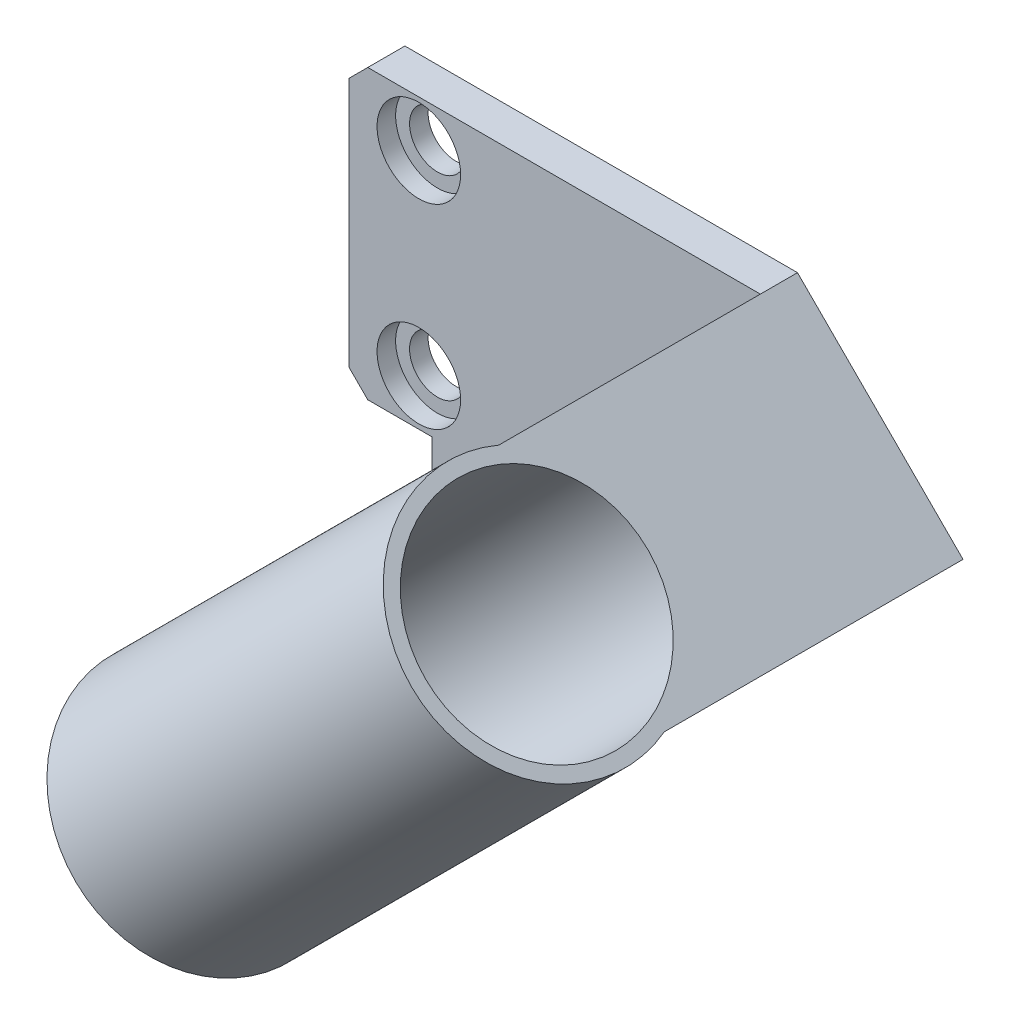
ISO-10303-21;
HEADER;
FILE_DESCRIPTION(('STEP AP214'),'2;1');
FILE_NAME('part.step','',(''),(''),'','','');
FILE_SCHEMA(('AUTOMOTIVE_DESIGN { 1 0 10303 214 1 1 1 1 }'));
ENDSEC;
DATA;
#1=APPLICATION_CONTEXT('core data for automotive mechanical design processes');
#2=APPLICATION_PROTOCOL_DEFINITION('international standard','automotive_design',2000,#1);
#3=PRODUCT_CONTEXT('',#1,'mechanical');
#4=PRODUCT('Part','Part','',(#3));
#5=PRODUCT_RELATED_PRODUCT_CATEGORY('part','',(#4));
#6=PRODUCT_DEFINITION_FORMATION('','',#4);
#7=PRODUCT_DEFINITION_CONTEXT('part definition',#1,'design');
#8=PRODUCT_DEFINITION('design','',#6,#7);
#9=PRODUCT_DEFINITION_SHAPE('','',#8);
#10=(LENGTH_UNIT() NAMED_UNIT(*) SI_UNIT(.MILLI.,.METRE.));
#11=(NAMED_UNIT(*) PLANE_ANGLE_UNIT() SI_UNIT($,.RADIAN.));
#12=(NAMED_UNIT(*) SI_UNIT($,.STERADIAN.) SOLID_ANGLE_UNIT());
#13=UNCERTAINTY_MEASURE_WITH_UNIT(LENGTH_MEASURE(1.E-05),#10,'distance_accuracy_value','');
#14=(GEOMETRIC_REPRESENTATION_CONTEXT(3) GLOBAL_UNCERTAINTY_ASSIGNED_CONTEXT((#13)) GLOBAL_UNIT_ASSIGNED_CONTEXT((#10,
#11,#12)) REPRESENTATION_CONTEXT('',''));
#15=CARTESIAN_POINT('',(0.,0.,0.));
#16=DIRECTION('',(0.,0.,1.));
#17=DIRECTION('',(1.,0.,0.));
#18=AXIS2_PLACEMENT_3D('',#15,#16,#17);
#19=CARTESIAN_POINT('',(0.,0.,4.));
#20=DIRECTION('',(0.,0.,-1.));
#21=DIRECTION('',(-1.,0.,0.));
#22=AXIS2_PLACEMENT_3D('',#19,#20,#21);
#23=PLANE('',#22);
#24=CARTESIAN_POINT('',(0.,0.,4.));
#25=DIRECTION('',(0.,0.,1.));
#26=DIRECTION('',(1.,0.,0.));
#27=AXIS2_PLACEMENT_3D('',#24,#25,#26);
#28=CIRCLE('',#27,4.5);
#29=CARTESIAN_POINT('',(4.5,0.,4.));
#30=VERTEX_POINT('',#29);
#31=EDGE_CURVE('E175',#30,#30,#28,.T.);
#32=ORIENTED_EDGE('',*,*,#31,.F.);
#33=EDGE_LOOP('',(#32));
#34=FACE_BOUND('',#33,.T.);
#35=CARTESIAN_POINT('',(0.,21.,4.));
#36=DIRECTION('',(0.,0.,1.));
#37=DIRECTION('',(1.,0.,0.));
#38=AXIS2_PLACEMENT_3D('',#35,#36,#37);
#39=CIRCLE('',#38,4.5);
#40=CARTESIAN_POINT('',(4.5,21.,4.));
#41=VERTEX_POINT('',#40);
#42=EDGE_CURVE('E180',#41,#41,#39,.T.);
#43=ORIENTED_EDGE('',*,*,#42,.F.);
#44=EDGE_LOOP('',(#43));
#45=FACE_BOUND('',#44,.T.);
#46=DIRECTION('',(-0.690146856604744,-0.723669341839622,0.));
#47=VECTOR('',#46,1.);
#48=CARTESIAN_POINT('',(1.42306306806194,-11.0769369319382,4.));
#49=LINE('',#48,#47);
#50=CARTESIAN_POINT('',(36.7824875962055,26.,4.));
#51=VERTEX_POINT('',#50);
#52=CARTESIAN_POINT('',(1.42306306806194,-11.0769369319382,4.));
#53=VERTEX_POINT('',#52);
#54=EDGE_CURVE('E151',#51,#53,#49,.T.);
#55=ORIENTED_EDGE('',*,*,#54,.F.);
#56=DIRECTION('',(-1.,0.,0.));
#57=VECTOR('',#56,1.);
#58=CARTESIAN_POINT('',(-7.5,26.,4.));
#59=LINE('',#58,#57);
#60=CARTESIAN_POINT('',(-5.49999999999999,26.,4.));
#61=VERTEX_POINT('',#60);
#62=EDGE_CURVE('E196',#51,#61,#59,.T.);
#63=ORIENTED_EDGE('',*,*,#62,.T.);
#64=DIRECTION('',(0.707106781186549,0.707106781186546,0.));
#65=VECTOR('',#64,1.);
#66=CARTESIAN_POINT('',(-7.5,24.,4.));
#67=LINE('',#66,#65);
#68=CARTESIAN_POINT('',(-7.5,24.,4.));
#69=VERTEX_POINT('',#68);
#70=EDGE_CURVE('E227',#61,#69,#67,.F.);
#71=ORIENTED_EDGE('',*,*,#70,.T.);
#72=DIRECTION('',(0.,-1.,0.));
#73=VECTOR('',#72,1.);
#74=CARTESIAN_POINT('',(-7.5,-4.99999999999999,4.));
#75=LINE('',#74,#73);
#76=CARTESIAN_POINT('',(-7.5,-2.99999999999998,4.));
#77=VERTEX_POINT('',#76);
#78=EDGE_CURVE('E198',#69,#77,#75,.T.);
#79=ORIENTED_EDGE('',*,*,#78,.T.);
#80=DIRECTION('',(-0.707106781186546,0.707106781186549,0.));
#81=VECTOR('',#80,1.);
#82=CARTESIAN_POINT('',(-5.5,-4.99999999999999,4.));
#83=LINE('',#82,#81);
#84=CARTESIAN_POINT('',(-5.5,-4.99999999999999,4.));
#85=VERTEX_POINT('',#84);
#86=EDGE_CURVE('E46',#77,#85,#83,.F.);
#87=ORIENTED_EDGE('',*,*,#86,.T.);
#88=DIRECTION('',(1.,0.,0.));
#89=VECTOR('',#88,1.);
#90=CARTESIAN_POINT('',(-7.5,-4.99999999999999,4.));
#91=LINE('',#90,#89);
#92=CARTESIAN_POINT('',(1.42306306806194,-4.99999999999999,4.));
#93=VERTEX_POINT('',#92);
#94=EDGE_CURVE('E202',#85,#93,#91,.T.);
#95=ORIENTED_EDGE('',*,*,#94,.T.);
#96=DIRECTION('',(0.,-1.,0.));
#97=VECTOR('',#96,1.);
#98=CARTESIAN_POINT('',(1.42306306806194,-11.0769369319382,4.));
#99=LINE('',#98,#97);
#100=EDGE_CURVE('E53',#93,#53,#99,.T.);
#101=ORIENTED_EDGE('',*,*,#100,.T.);
#102=EDGE_LOOP('',(#55,#63,#71,#79,#87,#95,#101));
#103=FACE_BOUND('',#102,.T.);
#104=ADVANCED_FACE('F38',(#34,#45,#103),#23,.F.);
#105=CARTESIAN_POINT('',(0.,0.,4.));
#106=DIRECTION('',(0.,0.,-1.));
#107=DIRECTION('',(-1.,0.,0.));
#108=AXIS2_PLACEMENT_3D('',#105,#106,#107);
#109=CYLINDRICAL_SURFACE('',#108,3.);
#110=CARTESIAN_POINT('',(0.,0.,0.));
#111=DIRECTION('',(0.,0.,1.));
#112=DIRECTION('',(1.,0.,0.));
#113=AXIS2_PLACEMENT_3D('',#110,#111,#112);
#114=CIRCLE('',#113,3.);
#115=CARTESIAN_POINT('',(3.,0.,0.));
#116=VERTEX_POINT('',#115);
#117=EDGE_CURVE('E191',#116,#116,#114,.T.);
#118=ORIENTED_EDGE('',*,*,#117,.F.);
#119=EDGE_LOOP('',(#118));
#120=FACE_BOUND('',#119,.T.);
#121=CARTESIAN_POINT('',(0.,0.,2.));
#122=DIRECTION('',(0.,0.,1.));
#123=DIRECTION('',(1.,0.,0.));
#124=AXIS2_PLACEMENT_3D('',#121,#122,#123);
#125=CIRCLE('',#124,3.);
#126=CARTESIAN_POINT('',(3.,0.,2.));
#127=VERTEX_POINT('',#126);
#128=EDGE_CURVE('E192',#127,#127,#125,.T.);
#129=ORIENTED_EDGE('',*,*,#128,.T.);
#130=EDGE_LOOP('',(#129));
#131=FACE_BOUND('',#130,.T.);
#132=ADVANCED_FACE('F273',(#120,#131),#109,.F.);
#133=CARTESIAN_POINT('',(0.,21.,4.));
#134=DIRECTION('',(0.,0.,-1.));
#135=DIRECTION('',(-1.,0.,0.));
#136=AXIS2_PLACEMENT_3D('',#133,#134,#135);
#137=CYLINDRICAL_SURFACE('',#136,3.);
#138=CARTESIAN_POINT('',(0.,21.,0.));
#139=DIRECTION('',(0.,0.,1.));
#140=DIRECTION('',(1.,0.,0.));
#141=AXIS2_PLACEMENT_3D('',#138,#139,#140);
#142=CIRCLE('',#141,3.);
#143=CARTESIAN_POINT('',(3.,21.,0.));
#144=VERTEX_POINT('',#143);
#145=EDGE_CURVE('E188',#144,#144,#142,.T.);
#146=ORIENTED_EDGE('',*,*,#145,.F.);
#147=EDGE_LOOP('',(#146));
#148=FACE_BOUND('',#147,.T.);
#149=CARTESIAN_POINT('',(0.,21.,2.));
#150=DIRECTION('',(0.,0.,1.));
#151=DIRECTION('',(1.,0.,0.));
#152=AXIS2_PLACEMENT_3D('',#149,#150,#151);
#153=CIRCLE('',#152,3.);
#154=CARTESIAN_POINT('',(3.,21.,2.));
#155=VERTEX_POINT('',#154);
#156=EDGE_CURVE('E179',#155,#155,#153,.T.);
#157=ORIENTED_EDGE('',*,*,#156,.T.);
#158=EDGE_LOOP('',(#157));
#159=FACE_BOUND('',#158,.T.);
#160=ADVANCED_FACE('F279',(#148,#159),#137,.F.);
#161=CARTESIAN_POINT('',(0.,0.,0.));
#162=DIRECTION('',(0.,0.,-1.));
#163=DIRECTION('',(-1.,0.,0.));
#164=AXIS2_PLACEMENT_3D('',#161,#162,#163);
#165=PLANE('',#164);
#166=DIRECTION('',(-1.,0.,0.));
#167=VECTOR('',#166,1.);
#168=CARTESIAN_POINT('',(-7.5,26.,0.));
#169=LINE('',#168,#167);
#170=CARTESIAN_POINT('',(36.7824875962055,26.,0.));
#171=VERTEX_POINT('',#170);
#172=CARTESIAN_POINT('',(-5.49999999999999,26.,0.));
#173=VERTEX_POINT('',#172);
#174=EDGE_CURVE('E195',#171,#173,#169,.T.);
#175=ORIENTED_EDGE('',*,*,#174,.F.);
#176=DIRECTION('',(-0.707106781186549,0.707106781186546,0.));
#177=VECTOR('',#176,1.);
#178=CARTESIAN_POINT('',(54.6118065465798,8.17068104962578,0.));
#179=LINE('',#178,#177);
#180=CARTESIAN_POINT('',(54.6118065465798,8.17068104962578,0.));
#181=VERTEX_POINT('',#180);
#182=EDGE_CURVE('E160',#181,#171,#179,.T.);
#183=ORIENTED_EDGE('',*,*,#182,.F.);
#184=DIRECTION('',(0.707106781186546,0.707106781186549,0.));
#185=VECTOR('',#184,1.);
#186=CARTESIAN_POINT('',(41.4411254969541,-4.99999999999999,0.));
#187=LINE('',#186,#185);
#188=CARTESIAN_POINT('',(18.3936258165389,-28.0474996804152,0.));
#189=VERTEX_POINT('',#188);
#190=EDGE_CURVE('E137',#189,#181,#187,.T.);
#191=ORIENTED_EDGE('',*,*,#190,.F.);
#192=DIRECTION('',(0.707106781186548,-0.707106781186548,0.));
#193=VECTOR('',#192,1.);
#194=CARTESIAN_POINT('',(1.42306306806194,-11.0769369319382,0.));
#195=LINE('',#194,#193);
#196=CARTESIAN_POINT('',(1.42306306806194,-11.0769369319382,0.));
#197=VERTEX_POINT('',#196);
#198=EDGE_CURVE('E134',#197,#189,#195,.T.);
#199=ORIENTED_EDGE('',*,*,#198,.F.);
#200=DIRECTION('',(0.,-1.,0.));
#201=VECTOR('',#200,1.);
#202=CARTESIAN_POINT('',(1.42306306806194,-11.0769369319382,0.));
#203=LINE('',#202,#201);
#204=CARTESIAN_POINT('',(1.42306306806194,-4.99999999999999,0.));
#205=VERTEX_POINT('',#204);
#206=EDGE_CURVE('E167',#205,#197,#203,.T.);
#207=ORIENTED_EDGE('',*,*,#206,.F.);
#208=DIRECTION('',(1.,0.,0.));
#209=VECTOR('',#208,1.);
#210=CARTESIAN_POINT('',(-7.5,-4.99999999999999,0.));
#211=LINE('',#210,#209);
#212=CARTESIAN_POINT('',(-5.5,-4.99999999999999,0.));
#213=VERTEX_POINT('',#212);
#214=EDGE_CURVE('E199',#213,#205,#211,.T.);
#215=ORIENTED_EDGE('',*,*,#214,.F.);
#216=DIRECTION('',(0.707106781186546,-0.707106781186549,0.));
#217=VECTOR('',#216,1.);
#218=CARTESIAN_POINT('',(-5.25000000000001,-5.24999999999998,0.));
#219=LINE('',#218,#217);
#220=CARTESIAN_POINT('',(-7.5,-2.99999999999998,0.));
#221=VERTEX_POINT('',#220);
#222=EDGE_CURVE('E220',#213,#221,#219,.F.);
#223=ORIENTED_EDGE('',*,*,#222,.T.);
#224=DIRECTION('',(0.,-1.,0.));
#225=VECTOR('',#224,1.);
#226=CARTESIAN_POINT('',(-7.5,-4.99999999999999,0.));
#227=LINE('',#226,#225);
#228=CARTESIAN_POINT('',(-7.5,24.,0.));
#229=VERTEX_POINT('',#228);
#230=EDGE_CURVE('E207',#229,#221,#227,.T.);
#231=ORIENTED_EDGE('',*,*,#230,.F.);
#232=DIRECTION('',(-0.707106781186549,-0.707106781186546,0.));
#233=VECTOR('',#232,1.);
#234=CARTESIAN_POINT('',(-15.75,15.7500000000001,0.));
#235=LINE('',#234,#233);
#236=EDGE_CURVE('E218',#229,#173,#235,.F.);
#237=ORIENTED_EDGE('',*,*,#236,.T.);
#238=EDGE_LOOP('',(#175,#183,#191,#199,#207,#215,#223,#231,#237));
#239=FACE_BOUND('',#238,.T.);
#240=ORIENTED_EDGE('',*,*,#117,.T.);
#241=EDGE_LOOP('',(#240));
#242=FACE_BOUND('',#241,.T.);
#243=ORIENTED_EDGE('',*,*,#145,.T.);
#244=EDGE_LOOP('',(#243));
#245=FACE_BOUND('',#244,.T.);
#246=ADVANCED_FACE('F241',(#239,#242,#245),#165,.T.);
#247=CARTESIAN_POINT('',(-7.5,26.,4.));
#248=DIRECTION('',(0.,-1.,0.));
#249=DIRECTION('',(0.,0.,-1.));
#250=AXIS2_PLACEMENT_3D('',#247,#248,#249);
#251=PLANE('',#250);
#252=ORIENTED_EDGE('',*,*,#174,.T.);
#253=DIRECTION('',(0.,0.,1.));
#254=VECTOR('',#253,1.);
#255=CARTESIAN_POINT('',(-5.49999999999999,26.,4.));
#256=LINE('',#255,#254);
#257=EDGE_CURVE('E11',#173,#61,#256,.T.);
#258=ORIENTED_EDGE('',*,*,#257,.T.);
#259=ORIENTED_EDGE('',*,*,#62,.F.);
#260=DIRECTION('',(0.,0.,1.));
#261=VECTOR('',#260,1.);
#262=CARTESIAN_POINT('',(36.7824875962055,26.,-75.8299060696244));
#263=LINE('',#262,#261);
#264=EDGE_CURVE('E163',#171,#51,#263,.T.);
#265=ORIENTED_EDGE('',*,*,#264,.F.);
#266=EDGE_LOOP('',(#252,#258,#259,#265));
#267=FACE_BOUND('',#266,.T.);
#268=ADVANCED_FACE('F249',(#267),#251,.F.);
#269=CARTESIAN_POINT('',(-7.5,-4.99999999999999,4.));
#270=DIRECTION('',(1.,0.,0.));
#271=DIRECTION('',(0.,0.,-1.));
#272=AXIS2_PLACEMENT_3D('',#269,#270,#271);
#273=PLANE('',#272);
#274=ORIENTED_EDGE('',*,*,#230,.T.);
#275=DIRECTION('',(0.,0.,1.));
#276=VECTOR('',#275,1.);
#277=CARTESIAN_POINT('',(-7.5,-2.99999999999998,4.));
#278=LINE('',#277,#276);
#279=EDGE_CURVE('E225',#221,#77,#278,.T.);
#280=ORIENTED_EDGE('',*,*,#279,.T.);
#281=ORIENTED_EDGE('',*,*,#78,.F.);
#282=DIRECTION('',(0.,0.,-1.));
#283=VECTOR('',#282,1.);
#284=CARTESIAN_POINT('',(-7.5,24.,4.));
#285=LINE('',#284,#283);
#286=EDGE_CURVE('E222',#69,#229,#285,.T.);
#287=ORIENTED_EDGE('',*,*,#286,.T.);
#288=EDGE_LOOP('',(#274,#280,#281,#287));
#289=FACE_BOUND('',#288,.T.);
#290=ADVANCED_FACE('F244',(#289),#273,.F.);
#291=CARTESIAN_POINT('',(-7.5,-4.99999999999999,4.));
#292=DIRECTION('',(0.,1.,0.));
#293=DIRECTION('',(0.,0.,1.));
#294=AXIS2_PLACEMENT_3D('',#291,#292,#293);
#295=PLANE('',#294);
#296=ORIENTED_EDGE('',*,*,#214,.T.);
#297=DIRECTION('',(0.,0.,1.));
#298=VECTOR('',#297,1.);
#299=CARTESIAN_POINT('',(1.42306306806194,-4.99999999999999,-75.8299060696244));
#300=LINE('',#299,#298);
#301=EDGE_CURVE('E159',#205,#93,#300,.T.);
#302=ORIENTED_EDGE('',*,*,#301,.T.);
#303=ORIENTED_EDGE('',*,*,#94,.F.);
#304=DIRECTION('',(0.,0.,-1.));
#305=VECTOR('',#304,1.);
#306=CARTESIAN_POINT('',(-5.5,-4.99999999999999,4.));
#307=LINE('',#306,#305);
#308=EDGE_CURVE('E205',#85,#213,#307,.T.);
#309=ORIENTED_EDGE('',*,*,#308,.T.);
#310=EDGE_LOOP('',(#296,#302,#303,#309));
#311=FACE_BOUND('',#310,.T.);
#312=ADVANCED_FACE('F236',(#311),#295,.F.);
#313=CARTESIAN_POINT('',(0.,21.,2.));
#314=DIRECTION('',(0.,0.,1.));
#315=DIRECTION('',(1.,0.,0.));
#316=AXIS2_PLACEMENT_3D('',#313,#314,#315);
#317=CYLINDRICAL_SURFACE('',#316,4.5);
#318=CARTESIAN_POINT('',(0.,21.,2.));
#319=DIRECTION('',(0.,0.,1.));
#320=DIRECTION('',(1.,0.,0.));
#321=AXIS2_PLACEMENT_3D('',#318,#319,#320);
#322=CIRCLE('',#321,4.5);
#323=CARTESIAN_POINT('',(4.5,21.,2.));
#324=VERTEX_POINT('',#323);
#325=EDGE_CURVE('E176',#324,#324,#322,.T.);
#326=ORIENTED_EDGE('',*,*,#325,.F.);
#327=EDGE_LOOP('',(#326));
#328=FACE_BOUND('',#327,.T.);
#329=ORIENTED_EDGE('',*,*,#42,.T.);
#330=EDGE_LOOP('',(#329));
#331=FACE_BOUND('',#330,.T.);
#332=ADVANCED_FACE('F290',(#328,#331),#317,.F.);
#333=CARTESIAN_POINT('',(0.,21.,2.));
#334=DIRECTION('',(0.,0.,1.));
#335=DIRECTION('',(1.,0.,0.));
#336=AXIS2_PLACEMENT_3D('',#333,#334,#335);
#337=PLANE('',#336);
#338=ORIENTED_EDGE('',*,*,#156,.F.);
#339=EDGE_LOOP('',(#338));
#340=FACE_BOUND('',#339,.T.);
#341=ORIENTED_EDGE('',*,*,#325,.T.);
#342=EDGE_LOOP('',(#341));
#343=FACE_BOUND('',#342,.T.);
#344=ADVANCED_FACE('F306',(#340,#343),#337,.T.);
#345=CARTESIAN_POINT('',(0.,0.,2.));
#346=DIRECTION('',(0.,0.,1.));
#347=DIRECTION('',(1.,0.,0.));
#348=AXIS2_PLACEMENT_3D('',#345,#346,#347);
#349=CYLINDRICAL_SURFACE('',#348,4.5);
#350=CARTESIAN_POINT('',(0.,0.,2.));
#351=DIRECTION('',(0.,0.,1.));
#352=DIRECTION('',(1.,0.,0.));
#353=AXIS2_PLACEMENT_3D('',#350,#351,#352);
#354=CIRCLE('',#353,4.5);
#355=CARTESIAN_POINT('',(4.5,0.,2.));
#356=VERTEX_POINT('',#355);
#357=EDGE_CURVE('E183',#356,#356,#354,.T.);
#358=ORIENTED_EDGE('',*,*,#357,.F.);
#359=EDGE_LOOP('',(#358));
#360=FACE_BOUND('',#359,.T.);
#361=ORIENTED_EDGE('',*,*,#31,.T.);
#362=EDGE_LOOP('',(#361));
#363=FACE_BOUND('',#362,.T.);
#364=ADVANCED_FACE('F300',(#360,#363),#349,.F.);
#365=CARTESIAN_POINT('',(0.,0.,2.));
#366=DIRECTION('',(0.,0.,1.));
#367=DIRECTION('',(1.,0.,0.));
#368=AXIS2_PLACEMENT_3D('',#365,#366,#367);
#369=PLANE('',#368);
#370=ORIENTED_EDGE('',*,*,#128,.F.);
#371=EDGE_LOOP('',(#370));
#372=FACE_BOUND('',#371,.T.);
#373=ORIENTED_EDGE('',*,*,#357,.T.);
#374=EDGE_LOOP('',(#373));
#375=FACE_BOUND('',#374,.T.);
#376=ADVANCED_FACE('F295',(#372,#375),#369,.T.);
#377=CARTESIAN_POINT('',(-5.5,-4.99999999999999,4.));
#378=DIRECTION('',(0.707106781186549,0.707106781186546,0.));
#379=DIRECTION('',(0.,0.,-1.));
#380=AXIS2_PLACEMENT_3D('',#377,#378,#379);
#381=PLANE('',#380);
#382=ORIENTED_EDGE('',*,*,#86,.F.);
#383=ORIENTED_EDGE('',*,*,#279,.F.);
#384=ORIENTED_EDGE('',*,*,#222,.F.);
#385=ORIENTED_EDGE('',*,*,#308,.F.);
#386=EDGE_LOOP('',(#382,#383,#384,#385));
#387=FACE_BOUND('',#386,.T.);
#388=ADVANCED_FACE('F238',(#387),#381,.F.);
#389=CARTESIAN_POINT('',(-7.5,24.,4.));
#390=DIRECTION('',(0.707106781186546,-0.707106781186549,0.));
#391=DIRECTION('',(0.,0.,-1.));
#392=AXIS2_PLACEMENT_3D('',#389,#390,#391);
#393=PLANE('',#392);
#394=ORIENTED_EDGE('',*,*,#70,.F.);
#395=ORIENTED_EDGE('',*,*,#257,.F.);
#396=ORIENTED_EDGE('',*,*,#236,.F.);
#397=ORIENTED_EDGE('',*,*,#286,.F.);
#398=EDGE_LOOP('',(#394,#395,#396,#397));
#399=FACE_BOUND('',#398,.T.);
#400=ADVANCED_FACE('F40',(#399),#393,.F.);
#401=CARTESIAN_POINT('',(1.42306306806194,-11.0769369319382,-75.8299060696244));
#402=DIRECTION('',(-1.,0.,0.));
#403=DIRECTION('',(0.,-1.,0.));
#404=AXIS2_PLACEMENT_3D('',#401,#402,#403);
#405=PLANE('',#404);
#406=ORIENTED_EDGE('',*,*,#301,.F.);
#407=ORIENTED_EDGE('',*,*,#206,.T.);
#408=DIRECTION('',(0.,0.,1.));
#409=VECTOR('',#408,1.);
#410=CARTESIAN_POINT('',(1.42306306806194,-11.0769369319382,-75.8299060696244));
#411=LINE('',#410,#409);
#412=EDGE_CURVE('E166',#197,#53,#411,.T.);
#413=ORIENTED_EDGE('',*,*,#412,.T.);
#414=ORIENTED_EDGE('',*,*,#100,.F.);
#415=EDGE_LOOP('',(#406,#407,#413,#414));
#416=FACE_BOUND('',#415,.T.);
#417=ADVANCED_FACE('F256',(#416),#405,.T.);
#418=CARTESIAN_POINT('',(1.42306306806194,-11.0769369319382,-75.8299060696244));
#419=DIRECTION('',(-0.707106781186547,-0.707106781186547,0.));
#420=DIRECTION('',(0.707106781186548,-0.707106781186548,0.));
#421=AXIS2_PLACEMENT_3D('',#418,#419,#420);
#422=PLANE('',#421);
#423=ORIENTED_EDGE('',*,*,#412,.F.);
#424=ORIENTED_EDGE('',*,*,#198,.T.);
#425=DIRECTION('',(0.,0.,1.));
#426=VECTOR('',#425,1.);
#427=CARTESIAN_POINT('',(18.3936258165389,-28.0474996804152,-75.8299060696244));
#428=LINE('',#427,#426);
#429=CARTESIAN_POINT('',(18.3936258165389,-28.0474996804152,32.1721958528836));
#430=VERTEX_POINT('',#429);
#431=EDGE_CURVE('E130',#189,#430,#428,.T.);
#432=ORIENTED_EDGE('',*,*,#431,.T.);
#433=CARTESIAN_POINT('',(9.47896634135184,-19.1328402052281,37.));
#434=DIRECTION('',(-0.707106781186547,-0.707106781186547,0.));
#435=DIRECTION('',(0.707106781186548,-0.707106781186548,0.));
#436=AXIS2_PLACEMENT_3D('',#433,#434,#435);
#437=CIRCLE('',#436,13.5);
#438=CARTESIAN_POINT('',(1.42306306806195,-11.0769369319382,29.7574282949497));
#439=VERTEX_POINT('',#438);
#440=EDGE_CURVE('E115',#439,#430,#437,.F.);
#441=ORIENTED_EDGE('',*,*,#440,.F.);
#442=DIRECTION('',(0.,0.,-1.));
#443=VECTOR('',#442,1.);
#444=CARTESIAN_POINT('',(1.42306306806194,-11.0769369319382,50.502));
#445=LINE('',#444,#443);
#446=EDGE_CURVE('E154',#439,#53,#445,.T.);
#447=ORIENTED_EDGE('',*,*,#446,.T.);
#448=EDGE_LOOP('',(#423,#424,#432,#441,#447));
#449=FACE_BOUND('',#448,.T.);
#450=CARTESIAN_POINT('',(9.47896634135184,-19.1328402052281,37.));
#451=DIRECTION('',(-0.707106781186547,-0.707106781186547,0.));
#452=DIRECTION('',(0.707106781186548,-0.707106781186548,0.));
#453=AXIS2_PLACEMENT_3D('',#450,#451,#452);
#454=CIRCLE('',#453,12.);
#455=CARTESIAN_POINT('',(17.9642477155904,-27.6181215794666,37.));
#456=VERTEX_POINT('',#455);
#457=EDGE_CURVE('E143',#456,#456,#454,.F.);
#458=ORIENTED_EDGE('',*,*,#457,.T.);
#459=EDGE_LOOP('',(#458));
#460=FACE_BOUND('',#459,.T.);
#461=ADVANCED_FACE('F132',(#449,#460),#422,.T.);
#462=CARTESIAN_POINT('',(41.4411254969541,-4.99999999999999,-75.8299060696244));
#463=DIRECTION('',(0.707106781186549,-0.707106781186546,0.));
#464=DIRECTION('',(0.707106781186546,0.707106781186549,0.));
#465=AXIS2_PLACEMENT_3D('',#462,#463,#464);
#466=PLANE('',#465);
#467=ORIENTED_EDGE('',*,*,#431,.F.);
#468=ORIENTED_EDGE('',*,*,#190,.T.);
#469=DIRECTION('',(0.,0.,1.));
#470=VECTOR('',#469,1.);
#471=CARTESIAN_POINT('',(54.6118065465798,8.17068104962578,-75.8299060696244));
#472=LINE('',#471,#470);
#473=CARTESIAN_POINT('',(54.6118065465798,8.17068104962578,32.1721958528837));
#474=VERTEX_POINT('',#473);
#475=EDGE_CURVE('E142',#181,#474,#472,.T.);
#476=ORIENTED_EDGE('',*,*,#475,.T.);
#477=DIRECTION('',(0.707106781186546,0.707106781186549,0.));
#478=VECTOR('',#477,1.);
#479=CARTESIAN_POINT('',(-8.60637418346104,-55.0474996804152,32.1721958528835));
#480=LINE('',#479,#478);
#481=EDGE_CURVE('E119',#474,#430,#480,.F.);
#482=ORIENTED_EDGE('',*,*,#481,.T.);
#483=EDGE_LOOP('',(#467,#468,#476,#482));
#484=FACE_BOUND('',#483,.T.);
#485=ADVANCED_FACE('F140',(#484),#466,.T.);
#486=CARTESIAN_POINT('',(54.6118065465798,8.17068104962578,-75.8299060696244));
#487=DIRECTION('',(0.707106781186546,0.707106781186549,0.));
#488=DIRECTION('',(-0.707106781186549,0.707106781186546,0.));
#489=AXIS2_PLACEMENT_3D('',#486,#487,#488);
#490=PLANE('',#489);
#491=ORIENTED_EDGE('',*,*,#475,.F.);
#492=ORIENTED_EDGE('',*,*,#182,.T.);
#493=ORIENTED_EDGE('',*,*,#264,.T.);
#494=DIRECTION('',(0.,0.,-1.));
#495=VECTOR('',#494,1.);
#496=CARTESIAN_POINT('',(36.7824875962055,26.,50.502));
#497=LINE('',#496,#495);
#498=CARTESIAN_POINT('',(36.7824875962055,26.,32.1721958528838));
#499=VERTEX_POINT('',#498);
#500=EDGE_CURVE('E145',#499,#51,#497,.T.);
#501=ORIENTED_EDGE('',*,*,#500,.F.);
#502=CARTESIAN_POINT('',(45.6971470713927,17.0853405248129,37.));
#503=DIRECTION('',(0.707106781186546,0.707106781186549,0.));
#504=DIRECTION('',(-0.707106781186549,0.707106781186546,0.));
#505=AXIS2_PLACEMENT_3D('',#502,#503,#504);
#506=CIRCLE('',#505,13.5);
#507=EDGE_CURVE('E148',#499,#474,#506,.T.);
#508=ORIENTED_EDGE('',*,*,#507,.T.);
#509=EDGE_LOOP('',(#491,#492,#493,#501,#508));
#510=FACE_BOUND('',#509,.T.);
#511=CARTESIAN_POINT('',(45.6971470713927,17.0853405248129,37.));
#512=DIRECTION('',(0.707106781186546,0.707106781186549,0.));
#513=DIRECTION('',(-0.707106781186549,0.707106781186546,0.));
#514=AXIS2_PLACEMENT_3D('',#511,#512,#513);
#515=CIRCLE('',#514,12.);
#516=CARTESIAN_POINT('',(37.2118656971541,25.5706218990515,37.));
#517=VERTEX_POINT('',#516);
#518=EDGE_CURVE('E126',#517,#517,#515,.T.);
#519=ORIENTED_EDGE('',*,*,#518,.F.);
#520=EDGE_LOOP('',(#519));
#521=FACE_BOUND('',#520,.T.);
#522=ADVANCED_FACE('F252',(#510,#521),#490,.T.);
#523=CARTESIAN_POINT('',(1.42306306806194,-11.0769369319382,50.502));
#524=DIRECTION('',(0.723669341839622,-0.690146856604744,0.));
#525=DIRECTION('',(0.690146856604744,0.723669341839622,0.));
#526=AXIS2_PLACEMENT_3D('',#523,#524,#525);
#527=PLANE('',#526);
#528=ORIENTED_EDGE('',*,*,#446,.F.);
#529=CARTESIAN_POINT('',(-330.280047976262,-358.891854522843,37.));
#530=DIRECTION('',(0.723669341839622,-0.690146856604744,0.));
#531=DIRECTION('',(0.690146856604744,0.723669341839622,0.));
#532=AXIS2_PLACEMENT_3D('',#529,#530,#531);
#533=ELLIPSE('',#532,569.524692404788,13.5);
#534=EDGE_CURVE('E122',#439,#499,#533,.T.);
#535=ORIENTED_EDGE('',*,*,#534,.T.);
#536=ORIENTED_EDGE('',*,*,#500,.T.);
#537=ORIENTED_EDGE('',*,*,#54,.T.);
#538=EDGE_LOOP('',(#528,#535,#536,#537));
#539=FACE_BOUND('',#538,.T.);
#540=ADVANCED_FACE('F255',(#539),#527,.F.);
#541=CARTESIAN_POINT('',(-17.5210336586481,-46.1328402052281,37.));
#542=DIRECTION('',(0.707106781186546,0.707106781186549,0.));
#543=DIRECTION('',(-0.707106781186549,0.707106781186546,0.));
#544=AXIS2_PLACEMENT_3D('',#541,#542,#543);
#545=CYLINDRICAL_SURFACE('',#544,13.5);
#546=ORIENTED_EDGE('',*,*,#440,.T.);
#547=ORIENTED_EDGE('',*,*,#481,.F.);
#548=ORIENTED_EDGE('',*,*,#507,.F.);
#549=ORIENTED_EDGE('',*,*,#534,.F.);
#550=EDGE_LOOP('',(#546,#547,#548,#549));
#551=FACE_BOUND('',#550,.T.);
#552=ADVANCED_FACE('F117',(#551),#545,.T.);
#553=CARTESIAN_POINT('',(-17.5210336586481,-46.1328402052281,37.));
#554=DIRECTION('',(0.707106781186546,0.707106781186549,0.));
#555=DIRECTION('',(-0.707106781186549,0.707106781186546,0.));
#556=AXIS2_PLACEMENT_3D('',#553,#554,#555);
#557=CYLINDRICAL_SURFACE('',#556,12.);
#558=ORIENTED_EDGE('',*,*,#518,.T.);
#559=EDGE_LOOP('',(#558));
#560=FACE_BOUND('',#559,.T.);
#561=ORIENTED_EDGE('',*,*,#457,.F.);
#562=EDGE_LOOP('',(#561));
#563=FACE_BOUND('',#562,.T.);
#564=ADVANCED_FACE('F262',(#560,#563),#557,.F.);
#565=CLOSED_SHELL('',(#104,#132,#160,#246,#268,#290,#312,#332,#344,#364,#376,#388,#400,#417,
#461,#485,#522,#540,#552,#564));
#566=MANIFOLD_SOLID_BREP('B2',#565);
#567=ADVANCED_BREP_SHAPE_REPRESENTATION('',(#18,#566),#14);
#568=SHAPE_DEFINITION_REPRESENTATION(#9,#567);
ENDSEC;
END-ISO-10303-21;
